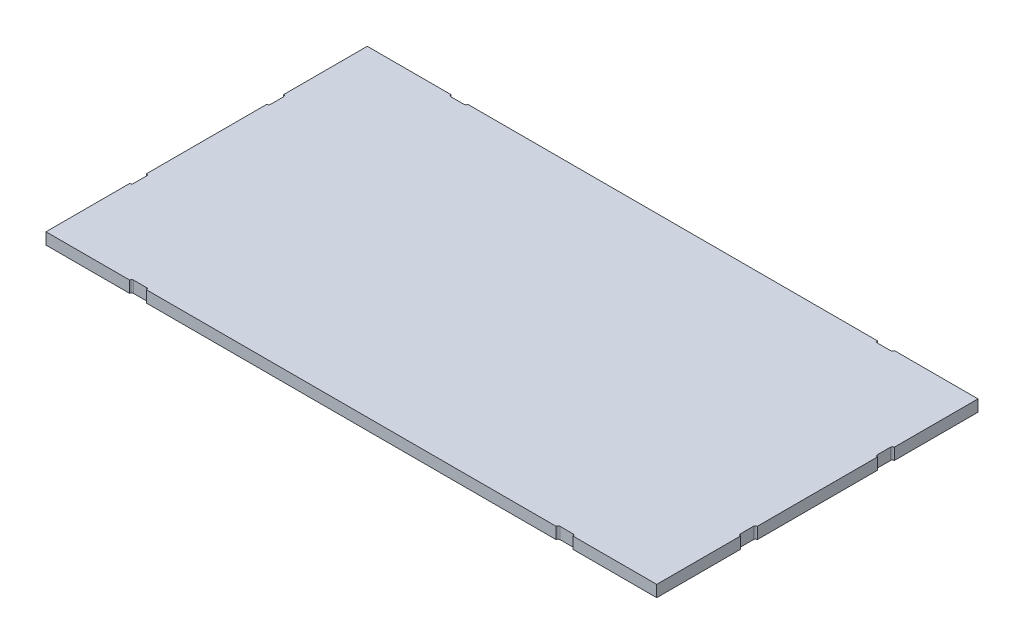
ISO-10303-21;
HEADER;
FILE_DESCRIPTION(('STEP AP214'),'2;1');
FILE_NAME('part.step','',(''),(''),'','','');
FILE_SCHEMA(('AUTOMOTIVE_DESIGN { 1 0 10303 214 1 1 1 1 }'));
ENDSEC;
DATA;
#1=APPLICATION_CONTEXT('core data for automotive mechanical design processes');
#2=APPLICATION_PROTOCOL_DEFINITION('international standard','automotive_design',2000,#1);
#3=PRODUCT_CONTEXT('',#1,'mechanical');
#4=PRODUCT('Part','Part','',(#3));
#5=PRODUCT_RELATED_PRODUCT_CATEGORY('part','',(#4));
#6=PRODUCT_DEFINITION_FORMATION('','',#4);
#7=PRODUCT_DEFINITION_CONTEXT('part definition',#1,'design');
#8=PRODUCT_DEFINITION('design','',#6,#7);
#9=PRODUCT_DEFINITION_SHAPE('','',#8);
#10=(LENGTH_UNIT() NAMED_UNIT(*) SI_UNIT(.MILLI.,.METRE.));
#11=(NAMED_UNIT(*) PLANE_ANGLE_UNIT() SI_UNIT($,.RADIAN.));
#12=(NAMED_UNIT(*) SI_UNIT($,.STERADIAN.) SOLID_ANGLE_UNIT());
#13=UNCERTAINTY_MEASURE_WITH_UNIT(LENGTH_MEASURE(1.E-05),#10,'distance_accuracy_value','');
#14=(GEOMETRIC_REPRESENTATION_CONTEXT(3) GLOBAL_UNCERTAINTY_ASSIGNED_CONTEXT((#13)) GLOBAL_UNIT_ASSIGNED_CONTEXT((#10,
#11,#12)) REPRESENTATION_CONTEXT('',''));
#15=CARTESIAN_POINT('',(0.,0.,0.));
#16=DIRECTION('',(0.,0.,1.));
#17=DIRECTION('',(1.,0.,0.));
#18=AXIS2_PLACEMENT_3D('',#15,#16,#17);
#19=CARTESIAN_POINT('',(-316.5,12.,-166.5));
#20=DIRECTION('',(0.,0.,1.));
#21=DIRECTION('',(1.,0.,0.));
#22=AXIS2_PLACEMENT_3D('',#19,#20,#21);
#23=PLANE('',#22);
#24=DIRECTION('',(-1.,0.,0.));
#25=VECTOR('',#24,1.);
#26=CARTESIAN_POINT('',(-316.5,0.,-166.5));
#27=LINE('',#26,#25);
#28=CARTESIAN_POINT('',(212.25,0.,-166.5));
#29=VERTEX_POINT('',#28);
#30=CARTESIAN_POINT('',(-212.25,0.,-166.5));
#31=VERTEX_POINT('',#30);
#32=EDGE_CURVE('E289',#29,#31,#27,.T.);
#33=ORIENTED_EDGE('',*,*,#32,.T.);
#34=DIRECTION('',(0.,1.,0.));
#35=VECTOR('',#34,1.);
#36=CARTESIAN_POINT('',(-212.25,0.,-166.5));
#37=LINE('',#36,#35);
#38=CARTESIAN_POINT('',(-212.25,12.,-166.5));
#39=VERTEX_POINT('',#38);
#40=EDGE_CURVE('E875',#31,#39,#37,.T.);
#41=ORIENTED_EDGE('',*,*,#40,.T.);
#42=DIRECTION('',(-1.,0.,0.));
#43=VECTOR('',#42,1.);
#44=CARTESIAN_POINT('',(-316.5,12.,-166.5));
#45=LINE('',#44,#43);
#46=CARTESIAN_POINT('',(212.25,12.,-166.5));
#47=VERTEX_POINT('',#46);
#48=EDGE_CURVE('E343',#47,#39,#45,.T.);
#49=ORIENTED_EDGE('',*,*,#48,.F.);
#50=DIRECTION('',(0.,1.,0.));
#51=VECTOR('',#50,1.);
#52=CARTESIAN_POINT('',(212.25,0.,-166.5));
#53=LINE('',#52,#51);
#54=EDGE_CURVE('E561',#29,#47,#53,.T.);
#55=ORIENTED_EDGE('',*,*,#54,.F.);
#56=EDGE_LOOP('',(#33,#41,#49,#55));
#57=FACE_BOUND('',#56,.T.);
#58=ADVANCED_FACE('F32',(#57),#23,.F.);
#59=CARTESIAN_POINT('',(316.5,0.,-166.5));
#60=VERTEX_POINT('',#59);
#61=CARTESIAN_POINT('',(229.75,0.,-166.5));
#62=VERTEX_POINT('',#61);
#63=EDGE_CURVE('E292',#60,#62,#27,.T.);
#64=ORIENTED_EDGE('',*,*,#63,.T.);
#65=DIRECTION('',(0.,1.,0.));
#66=VECTOR('',#65,1.);
#67=CARTESIAN_POINT('',(229.75,0.,-166.5));
#68=LINE('',#67,#66);
#69=CARTESIAN_POINT('',(229.75,12.,-166.5));
#70=VERTEX_POINT('',#69);
#71=EDGE_CURVE('E544',#62,#70,#68,.T.);
#72=ORIENTED_EDGE('',*,*,#71,.T.);
#73=CARTESIAN_POINT('',(316.5,12.,-166.5));
#74=VERTEX_POINT('',#73);
#75=EDGE_CURVE('E344',#74,#70,#45,.T.);
#76=ORIENTED_EDGE('',*,*,#75,.F.);
#77=DIRECTION('',(0.,-1.,0.));
#78=VECTOR('',#77,1.);
#79=CARTESIAN_POINT('',(316.5,12.,-166.5));
#80=LINE('',#79,#78);
#81=EDGE_CURVE('E11',#74,#60,#80,.T.);
#82=ORIENTED_EDGE('',*,*,#81,.T.);
#83=EDGE_LOOP('',(#64,#72,#76,#82));
#84=FACE_BOUND('',#83,.T.);
#85=ADVANCED_FACE('F543',(#84),#23,.F.);
#86=CARTESIAN_POINT('',(-316.5,12.,-166.5));
#87=DIRECTION('',(1.,0.,0.));
#88=DIRECTION('',(0.,0.,-1.));
#89=AXIS2_PLACEMENT_3D('',#86,#87,#88);
#90=PLANE('',#89);
#91=DIRECTION('',(0.,0.,1.));
#92=VECTOR('',#91,1.);
#93=CARTESIAN_POINT('',(-316.5,0.,-166.5));
#94=LINE('',#93,#92);
#95=CARTESIAN_POINT('',(-316.5,0.,-62.2499999999997));
#96=VERTEX_POINT('',#95);
#97=CARTESIAN_POINT('',(-316.5,0.,62.2499999999997));
#98=VERTEX_POINT('',#97);
#99=EDGE_CURVE('E304',#96,#98,#94,.T.);
#100=ORIENTED_EDGE('',*,*,#99,.T.);
#101=DIRECTION('',(0.,1.,0.));
#102=VECTOR('',#101,1.);
#103=CARTESIAN_POINT('',(-316.5,0.,62.2499999999997));
#104=LINE('',#103,#102);
#105=CARTESIAN_POINT('',(-316.5,12.,62.2499999999997));
#106=VERTEX_POINT('',#105);
#107=EDGE_CURVE('E578',#98,#106,#104,.T.);
#108=ORIENTED_EDGE('',*,*,#107,.T.);
#109=DIRECTION('',(0.,0.,1.));
#110=VECTOR('',#109,1.);
#111=CARTESIAN_POINT('',(-316.5,12.,-166.5));
#112=LINE('',#111,#110);
#113=CARTESIAN_POINT('',(-316.5,12.,-62.2499999999997));
#114=VERTEX_POINT('',#113);
#115=EDGE_CURVE('E350',#114,#106,#112,.T.);
#116=ORIENTED_EDGE('',*,*,#115,.F.);
#117=DIRECTION('',(0.,1.,0.));
#118=VECTOR('',#117,1.);
#119=CARTESIAN_POINT('',(-316.5,0.,-62.2499999999997));
#120=LINE('',#119,#118);
#121=EDGE_CURVE('E389',#96,#114,#120,.T.);
#122=ORIENTED_EDGE('',*,*,#121,.F.);
#123=EDGE_LOOP('',(#100,#108,#116,#122));
#124=FACE_BOUND('',#123,.T.);
#125=ADVANCED_FACE('F607',(#124),#90,.F.);
#126=CARTESIAN_POINT('',(-316.5,0.,-166.5));
#127=VERTEX_POINT('',#126);
#128=CARTESIAN_POINT('',(-316.5,0.,-79.7499999999997));
#129=VERTEX_POINT('',#128);
#130=EDGE_CURVE('E288',#127,#129,#94,.T.);
#131=ORIENTED_EDGE('',*,*,#130,.T.);
#132=DIRECTION('',(0.,1.,0.));
#133=VECTOR('',#132,1.);
#134=CARTESIAN_POINT('',(-316.5,0.,-79.7499999999997));
#135=LINE('',#134,#133);
#136=CARTESIAN_POINT('',(-316.5,12.,-79.7499999999997));
#137=VERTEX_POINT('',#136);
#138=EDGE_CURVE('E373',#129,#137,#135,.T.);
#139=ORIENTED_EDGE('',*,*,#138,.T.);
#140=CARTESIAN_POINT('',(-316.5,12.,-166.5));
#141=VERTEX_POINT('',#140);
#142=EDGE_CURVE('E351',#141,#137,#112,.T.);
#143=ORIENTED_EDGE('',*,*,#142,.F.);
#144=DIRECTION('',(0.,-1.,0.));
#145=VECTOR('',#144,1.);
#146=CARTESIAN_POINT('',(-316.5,12.,-166.5));
#147=LINE('',#146,#145);
#148=EDGE_CURVE('E40',#141,#127,#147,.T.);
#149=ORIENTED_EDGE('',*,*,#148,.T.);
#150=EDGE_LOOP('',(#131,#139,#143,#149));
#151=FACE_BOUND('',#150,.T.);
#152=ADVANCED_FACE('F372',(#151),#90,.F.);
#153=CARTESIAN_POINT('',(316.5,12.,-166.5));
#154=DIRECTION('',(-1.,0.,0.));
#155=DIRECTION('',(0.,0.,1.));
#156=AXIS2_PLACEMENT_3D('',#153,#154,#155);
#157=PLANE('',#156);
#158=DIRECTION('',(0.,0.,-1.));
#159=VECTOR('',#158,1.);
#160=CARTESIAN_POINT('',(316.5,0.,-166.5));
#161=LINE('',#160,#159);
#162=CARTESIAN_POINT('',(316.5,0.,62.2499999999997));
#163=VERTEX_POINT('',#162);
#164=CARTESIAN_POINT('',(316.5,0.,-62.2499999999997));
#165=VERTEX_POINT('',#164);
#166=EDGE_CURVE('E295',#163,#165,#161,.T.);
#167=ORIENTED_EDGE('',*,*,#166,.T.);
#168=DIRECTION('',(0.,1.,0.));
#169=VECTOR('',#168,1.);
#170=CARTESIAN_POINT('',(316.5,0.,-62.2499999999997));
#171=LINE('',#170,#169);
#172=CARTESIAN_POINT('',(316.5,12.,-62.2499999999997));
#173=VERTEX_POINT('',#172);
#174=EDGE_CURVE('E406',#165,#173,#171,.T.);
#175=ORIENTED_EDGE('',*,*,#174,.T.);
#176=DIRECTION('',(0.,0.,-1.));
#177=VECTOR('',#176,1.);
#178=CARTESIAN_POINT('',(316.5,12.,-166.5));
#179=LINE('',#178,#177);
#180=CARTESIAN_POINT('',(316.5,12.,62.2499999999997));
#181=VERTEX_POINT('',#180);
#182=EDGE_CURVE('E329',#181,#173,#179,.T.);
#183=ORIENTED_EDGE('',*,*,#182,.F.);
#184=DIRECTION('',(0.,1.,0.));
#185=VECTOR('',#184,1.);
#186=CARTESIAN_POINT('',(316.5,0.,62.2499999999997));
#187=LINE('',#186,#185);
#188=EDGE_CURVE('E451',#163,#181,#187,.T.);
#189=ORIENTED_EDGE('',*,*,#188,.F.);
#190=EDGE_LOOP('',(#167,#175,#183,#189));
#191=FACE_BOUND('',#190,.T.);
#192=ADVANCED_FACE('F529',(#191),#157,.F.);
#193=CARTESIAN_POINT('',(-316.5,12.,166.5));
#194=DIRECTION('',(0.,0.,-1.));
#195=DIRECTION('',(-1.,0.,0.));
#196=AXIS2_PLACEMENT_3D('',#193,#194,#195);
#197=PLANE('',#196);
#198=DIRECTION('',(1.,0.,0.));
#199=VECTOR('',#198,1.);
#200=CARTESIAN_POINT('',(-316.5,0.,166.5));
#201=LINE('',#200,#199);
#202=CARTESIAN_POINT('',(-212.25,0.,166.5));
#203=VERTEX_POINT('',#202);
#204=CARTESIAN_POINT('',(212.25,0.,166.5));
#205=VERTEX_POINT('',#204);
#206=EDGE_CURVE('E315',#203,#205,#201,.T.);
#207=ORIENTED_EDGE('',*,*,#206,.T.);
#208=DIRECTION('',(0.,1.,0.));
#209=VECTOR('',#208,1.);
#210=CARTESIAN_POINT('',(212.25,0.,166.5));
#211=LINE('',#210,#209);
#212=CARTESIAN_POINT('',(212.25,12.,166.5));
#213=VERTEX_POINT('',#212);
#214=EDGE_CURVE('E432',#205,#213,#211,.T.);
#215=ORIENTED_EDGE('',*,*,#214,.T.);
#216=DIRECTION('',(1.,0.,0.));
#217=VECTOR('',#216,1.);
#218=CARTESIAN_POINT('',(-316.5,12.,166.5));
#219=LINE('',#218,#217);
#220=CARTESIAN_POINT('',(-212.25,12.,166.5));
#221=VERTEX_POINT('',#220);
#222=EDGE_CURVE('E360',#221,#213,#219,.T.);
#223=ORIENTED_EDGE('',*,*,#222,.F.);
#224=DIRECTION('',(0.,1.,0.));
#225=VECTOR('',#224,1.);
#226=CARTESIAN_POINT('',(-212.25,0.,166.5));
#227=LINE('',#226,#225);
#228=EDGE_CURVE('E477',#203,#221,#227,.T.);
#229=ORIENTED_EDGE('',*,*,#228,.F.);
#230=EDGE_LOOP('',(#207,#215,#223,#229));
#231=FACE_BOUND('',#230,.T.);
#232=ADVANCED_FACE('F501',(#231),#197,.F.);
#233=CARTESIAN_POINT('',(316.5,0.,166.5));
#234=VERTEX_POINT('',#233);
#235=CARTESIAN_POINT('',(316.5,0.,79.7499999999997));
#236=VERTEX_POINT('',#235);
#237=EDGE_CURVE('E290',#234,#236,#161,.T.);
#238=ORIENTED_EDGE('',*,*,#237,.T.);
#239=DIRECTION('',(0.,1.,0.));
#240=VECTOR('',#239,1.);
#241=CARTESIAN_POINT('',(316.5,0.,79.7499999999997));
#242=LINE('',#241,#240);
#243=CARTESIAN_POINT('',(316.5,12.,79.7499999999997));
#244=VERTEX_POINT('',#243);
#245=EDGE_CURVE('E458',#236,#244,#242,.T.);
#246=ORIENTED_EDGE('',*,*,#245,.T.);
#247=CARTESIAN_POINT('',(316.5,12.,166.5));
#248=VERTEX_POINT('',#247);
#249=EDGE_CURVE('E331',#248,#244,#179,.T.);
#250=ORIENTED_EDGE('',*,*,#249,.F.);
#251=DIRECTION('',(0.,-1.,0.));
#252=VECTOR('',#251,1.);
#253=CARTESIAN_POINT('',(316.5,12.,166.5));
#254=LINE('',#253,#252);
#255=EDGE_CURVE('E365',#248,#234,#254,.T.);
#256=ORIENTED_EDGE('',*,*,#255,.T.);
#257=EDGE_LOOP('',(#238,#246,#250,#256));
#258=FACE_BOUND('',#257,.T.);
#259=ADVANCED_FACE('F512',(#258),#157,.F.);
#260=CARTESIAN_POINT('',(-316.5,0.,166.5));
#261=VERTEX_POINT('',#260);
#262=CARTESIAN_POINT('',(-229.75,0.,166.5));
#263=VERTEX_POINT('',#262);
#264=EDGE_CURVE('E316',#261,#263,#201,.T.);
#265=ORIENTED_EDGE('',*,*,#264,.T.);
#266=DIRECTION('',(0.,1.,0.));
#267=VECTOR('',#266,1.);
#268=CARTESIAN_POINT('',(-229.75,0.,166.5));
#269=LINE('',#268,#267);
#270=CARTESIAN_POINT('',(-229.75,12.,166.5));
#271=VERTEX_POINT('',#270);
#272=EDGE_CURVE('E484',#263,#271,#269,.T.);
#273=ORIENTED_EDGE('',*,*,#272,.T.);
#274=CARTESIAN_POINT('',(-316.5,12.,166.5));
#275=VERTEX_POINT('',#274);
#276=EDGE_CURVE('E361',#275,#271,#219,.T.);
#277=ORIENTED_EDGE('',*,*,#276,.F.);
#278=DIRECTION('',(0.,-1.,0.));
#279=VECTOR('',#278,1.);
#280=CARTESIAN_POINT('',(-316.5,12.,166.5));
#281=LINE('',#280,#279);
#282=EDGE_CURVE('E368',#275,#261,#281,.T.);
#283=ORIENTED_EDGE('',*,*,#282,.T.);
#284=EDGE_LOOP('',(#265,#273,#277,#283));
#285=FACE_BOUND('',#284,.T.);
#286=ADVANCED_FACE('F619',(#285),#197,.F.);
#287=CARTESIAN_POINT('',(316.5,12.,-79.7499999999997));
#288=VERTEX_POINT('',#287);
#289=EDGE_CURVE('E325',#288,#74,#179,.T.);
#290=ORIENTED_EDGE('',*,*,#289,.F.);
#291=DIRECTION('',(0.,1.,0.));
#292=VECTOR('',#291,1.);
#293=CARTESIAN_POINT('',(316.5,0.,-79.7499999999997));
#294=LINE('',#293,#292);
#295=CARTESIAN_POINT('',(316.5,0.,-79.7499999999997));
#296=VERTEX_POINT('',#295);
#297=EDGE_CURVE('E401',#296,#288,#294,.T.);
#298=ORIENTED_EDGE('',*,*,#297,.F.);
#299=EDGE_CURVE('E297',#296,#60,#161,.T.);
#300=ORIENTED_EDGE('',*,*,#299,.T.);
#301=ORIENTED_EDGE('',*,*,#81,.F.);
#302=EDGE_LOOP('',(#290,#298,#300,#301));
#303=FACE_BOUND('',#302,.T.);
#304=ADVANCED_FACE('F34',(#303),#157,.F.);
#305=CARTESIAN_POINT('',(-229.75,12.,-166.5));
#306=VERTEX_POINT('',#305);
#307=EDGE_CURVE('E281',#306,#141,#45,.T.);
#308=ORIENTED_EDGE('',*,*,#307,.F.);
#309=DIRECTION('',(0.,1.,0.));
#310=VECTOR('',#309,1.);
#311=CARTESIAN_POINT('',(-229.75,0.,-166.5));
#312=LINE('',#311,#310);
#313=CARTESIAN_POINT('',(-229.75,0.,-166.5));
#314=VERTEX_POINT('',#313);
#315=EDGE_CURVE('E268',#314,#306,#312,.T.);
#316=ORIENTED_EDGE('',*,*,#315,.F.);
#317=EDGE_CURVE('E279',#314,#127,#27,.T.);
#318=ORIENTED_EDGE('',*,*,#317,.T.);
#319=ORIENTED_EDGE('',*,*,#148,.F.);
#320=EDGE_LOOP('',(#308,#316,#318,#319));
#321=FACE_BOUND('',#320,.T.);
#322=ADVANCED_FACE('F277',(#321),#23,.F.);
#323=CARTESIAN_POINT('',(-316.5,12.,79.7499999999997));
#324=VERTEX_POINT('',#323);
#325=EDGE_CURVE('E348',#324,#275,#112,.T.);
#326=ORIENTED_EDGE('',*,*,#325,.F.);
#327=DIRECTION('',(0.,1.,0.));
#328=VECTOR('',#327,1.);
#329=CARTESIAN_POINT('',(-316.5,0.,79.7499999999997));
#330=LINE('',#329,#328);
#331=CARTESIAN_POINT('',(-316.5,0.,79.7499999999997));
#332=VERTEX_POINT('',#331);
#333=EDGE_CURVE('E573',#332,#324,#330,.T.);
#334=ORIENTED_EDGE('',*,*,#333,.F.);
#335=EDGE_CURVE('E300',#332,#261,#94,.T.);
#336=ORIENTED_EDGE('',*,*,#335,.T.);
#337=ORIENTED_EDGE('',*,*,#282,.F.);
#338=EDGE_LOOP('',(#326,#334,#336,#337));
#339=FACE_BOUND('',#338,.T.);
#340=ADVANCED_FACE('F618',(#339),#90,.F.);
#341=CARTESIAN_POINT('',(229.75,12.,166.5));
#342=VERTEX_POINT('',#341);
#343=EDGE_CURVE('E357',#342,#248,#219,.T.);
#344=ORIENTED_EDGE('',*,*,#343,.F.);
#345=DIRECTION('',(0.,1.,0.));
#346=VECTOR('',#345,1.);
#347=CARTESIAN_POINT('',(229.75,0.,166.5));
#348=LINE('',#347,#346);
#349=CARTESIAN_POINT('',(229.75,0.,166.5));
#350=VERTEX_POINT('',#349);
#351=EDGE_CURVE('E425',#350,#342,#348,.T.);
#352=ORIENTED_EDGE('',*,*,#351,.F.);
#353=EDGE_CURVE('E312',#350,#234,#201,.T.);
#354=ORIENTED_EDGE('',*,*,#353,.T.);
#355=ORIENTED_EDGE('',*,*,#255,.F.);
#356=EDGE_LOOP('',(#344,#352,#354,#355));
#357=FACE_BOUND('',#356,.T.);
#358=ADVANCED_FACE('F511',(#357),#197,.F.);
#359=CARTESIAN_POINT('',(0.,12.,0.));
#360=DIRECTION('',(0.,1.,0.));
#361=DIRECTION('',(0.,0.,1.));
#362=AXIS2_PLACEMENT_3D('',#359,#360,#361);
#363=PLANE('',#362);
#364=CARTESIAN_POINT('',(-214.25,12.,-166.5));
#365=DIRECTION('',(0.,1.,0.));
#366=DIRECTION('',(0.,0.,-1.));
#367=AXIS2_PLACEMENT_3D('',#364,#365,#366);
#368=CIRCLE('',#367,2.);
#369=CARTESIAN_POINT('',(-214.25,12.,-164.5));
#370=VERTEX_POINT('',#369);
#371=EDGE_CURVE('E273',#370,#39,#368,.T.);
#372=ORIENTED_EDGE('',*,*,#371,.F.);
#373=DIRECTION('',(1.,0.,0.));
#374=VECTOR('',#373,1.);
#375=CARTESIAN_POINT('',(-227.75,12.,-164.5));
#376=LINE('',#375,#374);
#377=CARTESIAN_POINT('',(-227.75,12.,-164.5));
#378=VERTEX_POINT('',#377);
#379=EDGE_CURVE('E864',#378,#370,#376,.T.);
#380=ORIENTED_EDGE('',*,*,#379,.F.);
#381=CARTESIAN_POINT('',(-227.75,12.,-166.5));
#382=DIRECTION('',(0.,1.,0.));
#383=DIRECTION('',(0.,0.,-1.));
#384=AXIS2_PLACEMENT_3D('',#381,#382,#383);
#385=CIRCLE('',#384,1.99999999999999);
#386=EDGE_CURVE('E867',#306,#378,#385,.T.);
#387=ORIENTED_EDGE('',*,*,#386,.F.);
#388=ORIENTED_EDGE('',*,*,#307,.T.);
#389=ORIENTED_EDGE('',*,*,#142,.T.);
#390=CARTESIAN_POINT('',(-316.5,12.,-77.7499999999997));
#391=DIRECTION('',(0.,1.,0.));
#392=DIRECTION('',(0.,0.,1.));
#393=AXIS2_PLACEMENT_3D('',#390,#391,#392);
#394=CIRCLE('',#393,2.);
#395=CARTESIAN_POINT('',(-314.5,12.,-77.7499999999997));
#396=VERTEX_POINT('',#395);
#397=EDGE_CURVE('E385',#396,#137,#394,.T.);
#398=ORIENTED_EDGE('',*,*,#397,.F.);
#399=DIRECTION('',(0.,0.,-1.));
#400=VECTOR('',#399,1.);
#401=CARTESIAN_POINT('',(-314.5,12.,-64.2499999999997));
#402=LINE('',#401,#400);
#403=CARTESIAN_POINT('',(-314.5,12.,-64.2499999999997));
#404=VERTEX_POINT('',#403);
#405=EDGE_CURVE('E595',#404,#396,#402,.T.);
#406=ORIENTED_EDGE('',*,*,#405,.F.);
#407=CARTESIAN_POINT('',(-316.5,12.,-64.2499999999997));
#408=DIRECTION('',(0.,1.,0.));
#409=DIRECTION('',(0.,0.,-1.));
#410=AXIS2_PLACEMENT_3D('',#407,#408,#409);
#411=CIRCLE('',#410,2.);
#412=EDGE_CURVE('E581',#114,#404,#411,.T.);
#413=ORIENTED_EDGE('',*,*,#412,.F.);
#414=ORIENTED_EDGE('',*,*,#115,.T.);
#415=CARTESIAN_POINT('',(-316.5,12.,64.2499999999997));
#416=DIRECTION('',(0.,1.,0.));
#417=DIRECTION('',(0.,0.,1.));
#418=AXIS2_PLACEMENT_3D('',#415,#416,#417);
#419=CIRCLE('',#418,2.);
#420=CARTESIAN_POINT('',(-314.5,12.,64.2499999999997));
#421=VERTEX_POINT('',#420);
#422=EDGE_CURVE('E568',#421,#106,#419,.T.);
#423=ORIENTED_EDGE('',*,*,#422,.F.);
#424=DIRECTION('',(0.,0.,-1.));
#425=VECTOR('',#424,1.);
#426=CARTESIAN_POINT('',(-314.5,12.,64.2499999999997));
#427=LINE('',#426,#425);
#428=CARTESIAN_POINT('',(-314.5,12.,77.7499999999997));
#429=VERTEX_POINT('',#428);
#430=EDGE_CURVE('E552',#429,#421,#427,.T.);
#431=ORIENTED_EDGE('',*,*,#430,.F.);
#432=CARTESIAN_POINT('',(-316.5,12.,77.7499999999997));
#433=DIRECTION('',(0.,1.,0.));
#434=DIRECTION('',(0.,0.,-1.));
#435=AXIS2_PLACEMENT_3D('',#432,#433,#434);
#436=CIRCLE('',#435,2.);
#437=EDGE_CURVE('E548',#324,#429,#436,.T.);
#438=ORIENTED_EDGE('',*,*,#437,.F.);
#439=ORIENTED_EDGE('',*,*,#325,.T.);
#440=ORIENTED_EDGE('',*,*,#276,.T.);
#441=CARTESIAN_POINT('',(-227.75,12.,166.5));
#442=DIRECTION('',(0.,1.,0.));
#443=DIRECTION('',(0.,0.,1.));
#444=AXIS2_PLACEMENT_3D('',#441,#442,#443);
#445=CIRCLE('',#444,1.99999999999999);
#446=CARTESIAN_POINT('',(-227.75,12.,164.5));
#447=VERTEX_POINT('',#446);
#448=EDGE_CURVE('E471',#447,#271,#445,.T.);
#449=ORIENTED_EDGE('',*,*,#448,.F.);
#450=DIRECTION('',(-1.,0.,0.));
#451=VECTOR('',#450,1.);
#452=CARTESIAN_POINT('',(-227.75,12.,164.5));
#453=LINE('',#452,#451);
#454=CARTESIAN_POINT('',(-214.25,12.,164.5));
#455=VERTEX_POINT('',#454);
#456=EDGE_CURVE('E480',#455,#447,#453,.T.);
#457=ORIENTED_EDGE('',*,*,#456,.F.);
#458=CARTESIAN_POINT('',(-214.25,12.,166.5));
#459=DIRECTION('',(0.,1.,0.));
#460=DIRECTION('',(0.,0.,1.));
#461=AXIS2_PLACEMENT_3D('',#458,#459,#460);
#462=CIRCLE('',#461,2.);
#463=EDGE_CURVE('E461',#221,#455,#462,.T.);
#464=ORIENTED_EDGE('',*,*,#463,.F.);
#465=ORIENTED_EDGE('',*,*,#222,.T.);
#466=CARTESIAN_POINT('',(214.25,12.,166.5));
#467=DIRECTION('',(0.,1.,0.));
#468=DIRECTION('',(0.,0.,-1.));
#469=AXIS2_PLACEMENT_3D('',#466,#467,#468);
#470=CIRCLE('',#469,2.);
#471=CARTESIAN_POINT('',(214.25,12.,164.5));
#472=VERTEX_POINT('',#471);
#473=EDGE_CURVE('E419',#472,#213,#470,.T.);
#474=ORIENTED_EDGE('',*,*,#473,.F.);
#475=DIRECTION('',(-1.,0.,0.));
#476=VECTOR('',#475,1.);
#477=CARTESIAN_POINT('',(227.75,12.,164.5));
#478=LINE('',#477,#476);
#479=CARTESIAN_POINT('',(227.75,12.,164.5));
#480=VERTEX_POINT('',#479);
#481=EDGE_CURVE('E428',#480,#472,#478,.T.);
#482=ORIENTED_EDGE('',*,*,#481,.F.);
#483=CARTESIAN_POINT('',(227.75,12.,166.5));
#484=DIRECTION('',(0.,1.,0.));
#485=DIRECTION('',(0.,0.,-1.));
#486=AXIS2_PLACEMENT_3D('',#483,#484,#485);
#487=CIRCLE('',#486,1.99999999999999);
#488=EDGE_CURVE('E409',#342,#480,#487,.T.);
#489=ORIENTED_EDGE('',*,*,#488,.F.);
#490=ORIENTED_EDGE('',*,*,#343,.T.);
#491=ORIENTED_EDGE('',*,*,#249,.T.);
#492=CARTESIAN_POINT('',(316.5,12.,77.7499999999997));
#493=DIRECTION('',(0.,1.,0.));
#494=DIRECTION('',(0.,0.,1.));
#495=AXIS2_PLACEMENT_3D('',#492,#493,#494);
#496=CIRCLE('',#495,2.);
#497=CARTESIAN_POINT('',(314.5,12.,77.7499999999997));
#498=VERTEX_POINT('',#497);
#499=EDGE_CURVE('E445',#498,#244,#496,.T.);
#500=ORIENTED_EDGE('',*,*,#499,.F.);
#501=DIRECTION('',(0.,0.,1.));
#502=VECTOR('',#501,1.);
#503=CARTESIAN_POINT('',(314.5,12.,64.2499999999997));
#504=LINE('',#503,#502);
#505=CARTESIAN_POINT('',(314.5,12.,64.2499999999997));
#506=VERTEX_POINT('',#505);
#507=EDGE_CURVE('E454',#506,#498,#504,.T.);
#508=ORIENTED_EDGE('',*,*,#507,.F.);
#509=CARTESIAN_POINT('',(316.5,12.,64.2499999999997));
#510=DIRECTION('',(0.,1.,0.));
#511=DIRECTION('',(0.,0.,-1.));
#512=AXIS2_PLACEMENT_3D('',#509,#510,#511);
#513=CIRCLE('',#512,2.);
#514=EDGE_CURVE('E435',#181,#506,#513,.T.);
#515=ORIENTED_EDGE('',*,*,#514,.F.);
#516=ORIENTED_EDGE('',*,*,#182,.T.);
#517=CARTESIAN_POINT('',(316.5,12.,-64.2499999999997));
#518=DIRECTION('',(0.,1.,0.));
#519=DIRECTION('',(0.,0.,1.));
#520=AXIS2_PLACEMENT_3D('',#517,#518,#519);
#521=CIRCLE('',#520,2.);
#522=CARTESIAN_POINT('',(314.5,12.,-64.2499999999997));
#523=VERTEX_POINT('',#522);
#524=EDGE_CURVE('E396',#523,#173,#521,.T.);
#525=ORIENTED_EDGE('',*,*,#524,.F.);
#526=DIRECTION('',(0.,0.,1.));
#527=VECTOR('',#526,1.);
#528=CARTESIAN_POINT('',(314.5,12.,-64.2499999999997));
#529=LINE('',#528,#527);
#530=CARTESIAN_POINT('',(314.5,12.,-77.7499999999997));
#531=VERTEX_POINT('',#530);
#532=EDGE_CURVE('E380',#531,#523,#529,.T.);
#533=ORIENTED_EDGE('',*,*,#532,.F.);
#534=CARTESIAN_POINT('',(316.5,12.,-77.7499999999997));
#535=DIRECTION('',(0.,1.,0.));
#536=DIRECTION('',(0.,0.,-1.));
#537=AXIS2_PLACEMENT_3D('',#534,#535,#536);
#538=CIRCLE('',#537,2.);
#539=EDGE_CURVE('E376',#288,#531,#538,.T.);
#540=ORIENTED_EDGE('',*,*,#539,.F.);
#541=ORIENTED_EDGE('',*,*,#289,.T.);
#542=ORIENTED_EDGE('',*,*,#75,.T.);
#543=CARTESIAN_POINT('',(227.75,12.,-166.5));
#544=DIRECTION('',(0.,1.,0.));
#545=DIRECTION('',(0.,0.,1.));
#546=AXIS2_PLACEMENT_3D('',#543,#544,#545);
#547=CIRCLE('',#546,1.99999999999999);
#548=CARTESIAN_POINT('',(227.75,12.,-164.5));
#549=VERTEX_POINT('',#548);
#550=EDGE_CURVE('E557',#549,#70,#547,.T.);
#551=ORIENTED_EDGE('',*,*,#550,.F.);
#552=DIRECTION('',(1.,0.,0.));
#553=VECTOR('',#552,1.);
#554=CARTESIAN_POINT('',(227.75,12.,-164.5));
#555=LINE('',#554,#553);
#556=CARTESIAN_POINT('',(214.25,12.,-164.5));
#557=VERTEX_POINT('',#556);
#558=EDGE_CURVE('E886',#557,#549,#555,.T.);
#559=ORIENTED_EDGE('',*,*,#558,.F.);
#560=CARTESIAN_POINT('',(214.25,12.,-166.5));
#561=DIRECTION('',(0.,1.,0.));
#562=DIRECTION('',(0.,0.,1.));
#563=AXIS2_PLACEMENT_3D('',#560,#561,#562);
#564=CIRCLE('',#563,2.);
#565=EDGE_CURVE('E877',#47,#557,#564,.T.);
#566=ORIENTED_EDGE('',*,*,#565,.F.);
#567=ORIENTED_EDGE('',*,*,#48,.T.);
#568=EDGE_LOOP('',(#372,#380,#387,#388,#389,#398,#406,#413,#414,#423,#431,#438,#439,#440,#449,
#457,#464,#465,#474,#482,#489,#490,#491,#500,#508,#515,#516,#525,#533,#540,#541,#542,#551,#559,
#566,#567));
#569=FACE_BOUND('',#568,.T.);
#570=ADVANCED_FACE('F499',(#569),#363,.T.);
#571=CARTESIAN_POINT('',(0.,0.,0.));
#572=DIRECTION('',(0.,1.,0.));
#573=DIRECTION('',(0.,0.,1.));
#574=AXIS2_PLACEMENT_3D('',#571,#572,#573);
#575=PLANE('',#574);
#576=DIRECTION('',(1.,0.,0.));
#577=VECTOR('',#576,1.);
#578=CARTESIAN_POINT('',(-227.75,0.,-164.5));
#579=LINE('',#578,#577);
#580=CARTESIAN_POINT('',(-227.75,0.,-164.5));
#581=VERTEX_POINT('',#580);
#582=CARTESIAN_POINT('',(-214.25,0.,-164.5));
#583=VERTEX_POINT('',#582);
#584=EDGE_CURVE('E47',#581,#583,#579,.T.);
#585=ORIENTED_EDGE('',*,*,#584,.T.);
#586=CARTESIAN_POINT('',(-214.25,0.,-166.5));
#587=DIRECTION('',(0.,1.,0.));
#588=DIRECTION('',(0.,0.,-1.));
#589=AXIS2_PLACEMENT_3D('',#586,#587,#588);
#590=CIRCLE('',#589,2.);
#591=EDGE_CURVE('E282',#583,#31,#590,.T.);
#592=ORIENTED_EDGE('',*,*,#591,.T.);
#593=ORIENTED_EDGE('',*,*,#32,.F.);
#594=CARTESIAN_POINT('',(214.25,0.,-166.5));
#595=DIRECTION('',(0.,1.,0.));
#596=DIRECTION('',(0.,0.,1.));
#597=AXIS2_PLACEMENT_3D('',#594,#595,#596);
#598=CIRCLE('',#597,2.);
#599=CARTESIAN_POINT('',(214.25,0.,-164.5));
#600=VERTEX_POINT('',#599);
#601=EDGE_CURVE('E880',#29,#600,#598,.T.);
#602=ORIENTED_EDGE('',*,*,#601,.T.);
#603=DIRECTION('',(1.,0.,0.));
#604=VECTOR('',#603,1.);
#605=CARTESIAN_POINT('',(227.75,0.,-164.5));
#606=LINE('',#605,#604);
#607=CARTESIAN_POINT('',(227.75,0.,-164.5));
#608=VERTEX_POINT('',#607);
#609=EDGE_CURVE('E55',#600,#608,#606,.T.);
#610=ORIENTED_EDGE('',*,*,#609,.T.);
#611=CARTESIAN_POINT('',(227.75,0.,-166.5));
#612=DIRECTION('',(0.,1.,0.));
#613=DIRECTION('',(0.,0.,1.));
#614=AXIS2_PLACEMENT_3D('',#611,#612,#613);
#615=CIRCLE('',#614,1.99999999999999);
#616=EDGE_CURVE('E563',#608,#62,#615,.T.);
#617=ORIENTED_EDGE('',*,*,#616,.T.);
#618=ORIENTED_EDGE('',*,*,#63,.F.);
#619=ORIENTED_EDGE('',*,*,#299,.F.);
#620=CARTESIAN_POINT('',(316.5,0.,-77.7499999999997));
#621=DIRECTION('',(0.,1.,0.));
#622=DIRECTION('',(0.,0.,-1.));
#623=AXIS2_PLACEMENT_3D('',#620,#621,#622);
#624=CIRCLE('',#623,2.);
#625=CARTESIAN_POINT('',(314.5,0.,-77.7499999999997));
#626=VERTEX_POINT('',#625);
#627=EDGE_CURVE('E392',#296,#626,#624,.T.);
#628=ORIENTED_EDGE('',*,*,#627,.T.);
#629=DIRECTION('',(0.,0.,1.));
#630=VECTOR('',#629,1.);
#631=CARTESIAN_POINT('',(314.5,0.,-64.2499999999997));
#632=LINE('',#631,#630);
#633=CARTESIAN_POINT('',(314.5,0.,-64.2499999999997));
#634=VERTEX_POINT('',#633);
#635=EDGE_CURVE('E395',#626,#634,#632,.T.);
#636=ORIENTED_EDGE('',*,*,#635,.T.);
#637=CARTESIAN_POINT('',(316.5,0.,-64.2499999999997));
#638=DIRECTION('',(0.,1.,0.));
#639=DIRECTION('',(0.,0.,1.));
#640=AXIS2_PLACEMENT_3D('',#637,#638,#639);
#641=CIRCLE('',#640,2.);
#642=EDGE_CURVE('E399',#634,#165,#641,.T.);
#643=ORIENTED_EDGE('',*,*,#642,.T.);
#644=ORIENTED_EDGE('',*,*,#166,.F.);
#645=CARTESIAN_POINT('',(316.5,0.,64.2499999999997));
#646=DIRECTION('',(0.,1.,0.));
#647=DIRECTION('',(0.,0.,-1.));
#648=AXIS2_PLACEMENT_3D('',#645,#646,#647);
#649=CIRCLE('',#648,2.);
#650=CARTESIAN_POINT('',(314.5,0.,64.2499999999997));
#651=VERTEX_POINT('',#650);
#652=EDGE_CURVE('E441',#163,#651,#649,.T.);
#653=ORIENTED_EDGE('',*,*,#652,.T.);
#654=DIRECTION('',(0.,0.,1.));
#655=VECTOR('',#654,1.);
#656=CARTESIAN_POINT('',(314.5,0.,64.2499999999997));
#657=LINE('',#656,#655);
#658=CARTESIAN_POINT('',(314.5,0.,77.7499999999997));
#659=VERTEX_POINT('',#658);
#660=EDGE_CURVE('E444',#651,#659,#657,.T.);
#661=ORIENTED_EDGE('',*,*,#660,.T.);
#662=CARTESIAN_POINT('',(316.5,0.,77.7499999999997));
#663=DIRECTION('',(0.,1.,0.));
#664=DIRECTION('',(0.,0.,1.));
#665=AXIS2_PLACEMENT_3D('',#662,#663,#664);
#666=CIRCLE('',#665,2.);
#667=EDGE_CURVE('E448',#659,#236,#666,.T.);
#668=ORIENTED_EDGE('',*,*,#667,.T.);
#669=ORIENTED_EDGE('',*,*,#237,.F.);
#670=ORIENTED_EDGE('',*,*,#353,.F.);
#671=CARTESIAN_POINT('',(227.75,0.,166.5));
#672=DIRECTION('',(0.,1.,0.));
#673=DIRECTION('',(0.,0.,-1.));
#674=AXIS2_PLACEMENT_3D('',#671,#672,#673);
#675=CIRCLE('',#674,1.99999999999999);
#676=CARTESIAN_POINT('',(227.75,0.,164.5));
#677=VERTEX_POINT('',#676);
#678=EDGE_CURVE('E415',#350,#677,#675,.T.);
#679=ORIENTED_EDGE('',*,*,#678,.T.);
#680=DIRECTION('',(-1.,0.,0.));
#681=VECTOR('',#680,1.);
#682=CARTESIAN_POINT('',(227.75,0.,164.5));
#683=LINE('',#682,#681);
#684=CARTESIAN_POINT('',(214.25,0.,164.5));
#685=VERTEX_POINT('',#684);
#686=EDGE_CURVE('E418',#677,#685,#683,.T.);
#687=ORIENTED_EDGE('',*,*,#686,.T.);
#688=CARTESIAN_POINT('',(214.25,0.,166.5));
#689=DIRECTION('',(0.,1.,0.));
#690=DIRECTION('',(0.,0.,-1.));
#691=AXIS2_PLACEMENT_3D('',#688,#689,#690);
#692=CIRCLE('',#691,2.);
#693=EDGE_CURVE('E422',#685,#205,#692,.T.);
#694=ORIENTED_EDGE('',*,*,#693,.T.);
#695=ORIENTED_EDGE('',*,*,#206,.F.);
#696=CARTESIAN_POINT('',(-214.25,0.,166.5));
#697=DIRECTION('',(0.,1.,0.));
#698=DIRECTION('',(0.,0.,1.));
#699=AXIS2_PLACEMENT_3D('',#696,#697,#698);
#700=CIRCLE('',#699,2.);
#701=CARTESIAN_POINT('',(-214.25,0.,164.5));
#702=VERTEX_POINT('',#701);
#703=EDGE_CURVE('E467',#203,#702,#700,.T.);
#704=ORIENTED_EDGE('',*,*,#703,.T.);
#705=DIRECTION('',(-1.,0.,0.));
#706=VECTOR('',#705,1.);
#707=CARTESIAN_POINT('',(-227.75,0.,164.5));
#708=LINE('',#707,#706);
#709=CARTESIAN_POINT('',(-227.75,0.,164.5));
#710=VERTEX_POINT('',#709);
#711=EDGE_CURVE('E470',#702,#710,#708,.T.);
#712=ORIENTED_EDGE('',*,*,#711,.T.);
#713=CARTESIAN_POINT('',(-227.75,0.,166.5));
#714=DIRECTION('',(0.,1.,0.));
#715=DIRECTION('',(0.,0.,1.));
#716=AXIS2_PLACEMENT_3D('',#713,#714,#715);
#717=CIRCLE('',#716,1.99999999999999);
#718=EDGE_CURVE('E474',#710,#263,#717,.T.);
#719=ORIENTED_EDGE('',*,*,#718,.T.);
#720=ORIENTED_EDGE('',*,*,#264,.F.);
#721=ORIENTED_EDGE('',*,*,#335,.F.);
#722=CARTESIAN_POINT('',(-316.5,0.,77.7499999999997));
#723=DIRECTION('',(0.,1.,0.));
#724=DIRECTION('',(0.,0.,-1.));
#725=AXIS2_PLACEMENT_3D('',#722,#723,#724);
#726=CIRCLE('',#725,2.);
#727=CARTESIAN_POINT('',(-314.5,0.,77.7499999999997));
#728=VERTEX_POINT('',#727);
#729=EDGE_CURVE('E564',#332,#728,#726,.T.);
#730=ORIENTED_EDGE('',*,*,#729,.T.);
#731=DIRECTION('',(0.,0.,-1.));
#732=VECTOR('',#731,1.);
#733=CARTESIAN_POINT('',(-314.5,0.,64.2499999999997));
#734=LINE('',#733,#732);
#735=CARTESIAN_POINT('',(-314.5,0.,64.2499999999997));
#736=VERTEX_POINT('',#735);
#737=EDGE_CURVE('E567',#728,#736,#734,.T.);
#738=ORIENTED_EDGE('',*,*,#737,.T.);
#739=CARTESIAN_POINT('',(-316.5,0.,64.2499999999997));
#740=DIRECTION('',(0.,1.,0.));
#741=DIRECTION('',(0.,0.,1.));
#742=AXIS2_PLACEMENT_3D('',#739,#740,#741);
#743=CIRCLE('',#742,2.);
#744=EDGE_CURVE('E571',#736,#98,#743,.T.);
#745=ORIENTED_EDGE('',*,*,#744,.T.);
#746=ORIENTED_EDGE('',*,*,#99,.F.);
#747=CARTESIAN_POINT('',(-316.5,0.,-64.2499999999997));
#748=DIRECTION('',(0.,1.,0.));
#749=DIRECTION('',(0.,0.,-1.));
#750=AXIS2_PLACEMENT_3D('',#747,#748,#749);
#751=CIRCLE('',#750,2.);
#752=CARTESIAN_POINT('',(-314.5,0.,-64.2499999999997));
#753=VERTEX_POINT('',#752);
#754=EDGE_CURVE('E587',#96,#753,#751,.T.);
#755=ORIENTED_EDGE('',*,*,#754,.T.);
#756=DIRECTION('',(0.,0.,-1.));
#757=VECTOR('',#756,1.);
#758=CARTESIAN_POINT('',(-314.5,0.,-64.2499999999997));
#759=LINE('',#758,#757);
#760=CARTESIAN_POINT('',(-314.5,0.,-77.7499999999997));
#761=VERTEX_POINT('',#760);
#762=EDGE_CURVE('E590',#753,#761,#759,.T.);
#763=ORIENTED_EDGE('',*,*,#762,.T.);
#764=CARTESIAN_POINT('',(-316.5,0.,-77.7499999999997));
#765=DIRECTION('',(0.,1.,0.));
#766=DIRECTION('',(0.,0.,1.));
#767=AXIS2_PLACEMENT_3D('',#764,#765,#766);
#768=CIRCLE('',#767,2.);
#769=EDGE_CURVE('E391',#761,#129,#768,.T.);
#770=ORIENTED_EDGE('',*,*,#769,.T.);
#771=ORIENTED_EDGE('',*,*,#130,.F.);
#772=ORIENTED_EDGE('',*,*,#317,.F.);
#773=CARTESIAN_POINT('',(-227.75,0.,-166.5));
#774=DIRECTION('',(0.,1.,0.));
#775=DIRECTION('',(0.,0.,-1.));
#776=AXIS2_PLACEMENT_3D('',#773,#774,#775);
#777=CIRCLE('',#776,1.99999999999999);
#778=EDGE_CURVE('E264',#314,#581,#777,.T.);
#779=ORIENTED_EDGE('',*,*,#778,.T.);
#780=EDGE_LOOP('',(#585,#592,#593,#602,#610,#617,#618,#619,#628,#636,#643,#644,#653,#661,#668,
#669,#670,#679,#687,#694,#695,#704,#712,#719,#720,#721,#730,#738,#745,#746,#755,#763,#770,#771,
#772,#779));
#781=FACE_BOUND('',#780,.T.);
#782=ADVANCED_FACE('F285',(#781),#575,.F.);
#783=CARTESIAN_POINT('',(-227.75,0.,166.5));
#784=DIRECTION('',(0.,1.,0.));
#785=DIRECTION('',(0.,0.,1.));
#786=AXIS2_PLACEMENT_3D('',#783,#784,#785);
#787=CYLINDRICAL_SURFACE('',#786,1.99999999999999);
#788=ORIENTED_EDGE('',*,*,#448,.T.);
#789=ORIENTED_EDGE('',*,*,#272,.F.);
#790=ORIENTED_EDGE('',*,*,#718,.F.);
#791=DIRECTION('',(0.,1.,0.));
#792=VECTOR('',#791,1.);
#793=CARTESIAN_POINT('',(-227.75,0.,164.5));
#794=LINE('',#793,#792);
#795=EDGE_CURVE('E486',#710,#447,#794,.T.);
#796=ORIENTED_EDGE('',*,*,#795,.T.);
#797=EDGE_LOOP('',(#788,#789,#790,#796));
#798=FACE_BOUND('',#797,.T.);
#799=ADVANCED_FACE('F622',(#798),#787,.F.);
#800=CARTESIAN_POINT('',(-227.75,0.,164.5));
#801=DIRECTION('',(0.,0.,-1.));
#802=DIRECTION('',(-1.,0.,0.));
#803=AXIS2_PLACEMENT_3D('',#800,#801,#802);
#804=PLANE('',#803);
#805=ORIENTED_EDGE('',*,*,#456,.T.);
#806=ORIENTED_EDGE('',*,*,#795,.F.);
#807=ORIENTED_EDGE('',*,*,#711,.F.);
#808=DIRECTION('',(0.,1.,0.));
#809=VECTOR('',#808,1.);
#810=CARTESIAN_POINT('',(-214.25,0.,164.5));
#811=LINE('',#810,#809);
#812=EDGE_CURVE('E488',#702,#455,#811,.T.);
#813=ORIENTED_EDGE('',*,*,#812,.T.);
#814=EDGE_LOOP('',(#805,#806,#807,#813));
#815=FACE_BOUND('',#814,.T.);
#816=ADVANCED_FACE('F624',(#815),#804,.F.);
#817=CARTESIAN_POINT('',(-214.25,0.,166.5));
#818=DIRECTION('',(0.,1.,0.));
#819=DIRECTION('',(0.,0.,1.));
#820=AXIS2_PLACEMENT_3D('',#817,#818,#819);
#821=CYLINDRICAL_SURFACE('',#820,2.);
#822=ORIENTED_EDGE('',*,*,#463,.T.);
#823=ORIENTED_EDGE('',*,*,#812,.F.);
#824=ORIENTED_EDGE('',*,*,#703,.F.);
#825=ORIENTED_EDGE('',*,*,#228,.T.);
#826=EDGE_LOOP('',(#822,#823,#824,#825));
#827=FACE_BOUND('',#826,.T.);
#828=ADVANCED_FACE('F492',(#827),#821,.F.);
#829=CARTESIAN_POINT('',(316.5,0.,77.7499999999997));
#830=DIRECTION('',(0.,1.,0.));
#831=DIRECTION('',(0.,0.,1.));
#832=AXIS2_PLACEMENT_3D('',#829,#830,#831);
#833=CYLINDRICAL_SURFACE('',#832,2.);
#834=ORIENTED_EDGE('',*,*,#499,.T.);
#835=ORIENTED_EDGE('',*,*,#245,.F.);
#836=ORIENTED_EDGE('',*,*,#667,.F.);
#837=DIRECTION('',(0.,1.,0.));
#838=VECTOR('',#837,1.);
#839=CARTESIAN_POINT('',(314.5,0.,77.7499999999997));
#840=LINE('',#839,#838);
#841=EDGE_CURVE('E462',#659,#498,#840,.T.);
#842=ORIENTED_EDGE('',*,*,#841,.T.);
#843=EDGE_LOOP('',(#834,#835,#836,#842));
#844=FACE_BOUND('',#843,.T.);
#845=ADVANCED_FACE('F515',(#844),#833,.F.);
#846=CARTESIAN_POINT('',(314.5,0.,64.2499999999997));
#847=DIRECTION('',(-1.,0.,0.));
#848=DIRECTION('',(0.,0.,1.));
#849=AXIS2_PLACEMENT_3D('',#846,#847,#848);
#850=PLANE('',#849);
#851=ORIENTED_EDGE('',*,*,#507,.T.);
#852=ORIENTED_EDGE('',*,*,#841,.F.);
#853=ORIENTED_EDGE('',*,*,#660,.F.);
#854=DIRECTION('',(0.,1.,0.));
#855=VECTOR('',#854,1.);
#856=CARTESIAN_POINT('',(314.5,0.,64.2499999999997));
#857=LINE('',#856,#855);
#858=EDGE_CURVE('E464',#651,#506,#857,.T.);
#859=ORIENTED_EDGE('',*,*,#858,.T.);
#860=EDGE_LOOP('',(#851,#852,#853,#859));
#861=FACE_BOUND('',#860,.T.);
#862=ADVANCED_FACE('F519',(#861),#850,.F.);
#863=CARTESIAN_POINT('',(316.5,0.,64.2499999999997));
#864=DIRECTION('',(0.,1.,0.));
#865=DIRECTION('',(0.,0.,1.));
#866=AXIS2_PLACEMENT_3D('',#863,#864,#865);
#867=CYLINDRICAL_SURFACE('',#866,2.);
#868=ORIENTED_EDGE('',*,*,#514,.T.);
#869=ORIENTED_EDGE('',*,*,#858,.F.);
#870=ORIENTED_EDGE('',*,*,#652,.F.);
#871=ORIENTED_EDGE('',*,*,#188,.T.);
#872=EDGE_LOOP('',(#868,#869,#870,#871));
#873=FACE_BOUND('',#872,.T.);
#874=ADVANCED_FACE('F521',(#873),#867,.F.);
#875=CARTESIAN_POINT('',(214.25,0.,166.5));
#876=DIRECTION('',(0.,1.,0.));
#877=DIRECTION('',(0.,0.,1.));
#878=AXIS2_PLACEMENT_3D('',#875,#876,#877);
#879=CYLINDRICAL_SURFACE('',#878,2.);
#880=ORIENTED_EDGE('',*,*,#473,.T.);
#881=ORIENTED_EDGE('',*,*,#214,.F.);
#882=ORIENTED_EDGE('',*,*,#693,.F.);
#883=DIRECTION('',(0.,1.,0.));
#884=VECTOR('',#883,1.);
#885=CARTESIAN_POINT('',(214.25,0.,164.5));
#886=LINE('',#885,#884);
#887=EDGE_CURVE('E436',#685,#472,#886,.T.);
#888=ORIENTED_EDGE('',*,*,#887,.T.);
#889=EDGE_LOOP('',(#880,#881,#882,#888));
#890=FACE_BOUND('',#889,.T.);
#891=ADVANCED_FACE('F504',(#890),#879,.F.);
#892=CARTESIAN_POINT('',(227.75,0.,164.5));
#893=DIRECTION('',(0.,0.,-1.));
#894=DIRECTION('',(-1.,0.,0.));
#895=AXIS2_PLACEMENT_3D('',#892,#893,#894);
#896=PLANE('',#895);
#897=ORIENTED_EDGE('',*,*,#481,.T.);
#898=ORIENTED_EDGE('',*,*,#887,.F.);
#899=ORIENTED_EDGE('',*,*,#686,.F.);
#900=DIRECTION('',(0.,1.,0.));
#901=VECTOR('',#900,1.);
#902=CARTESIAN_POINT('',(227.75,0.,164.5));
#903=LINE('',#902,#901);
#904=EDGE_CURVE('E438',#677,#480,#903,.T.);
#905=ORIENTED_EDGE('',*,*,#904,.T.);
#906=EDGE_LOOP('',(#897,#898,#899,#905));
#907=FACE_BOUND('',#906,.T.);
#908=ADVANCED_FACE('F507',(#907),#896,.F.);
#909=CARTESIAN_POINT('',(227.75,0.,166.5));
#910=DIRECTION('',(0.,1.,0.));
#911=DIRECTION('',(0.,0.,1.));
#912=AXIS2_PLACEMENT_3D('',#909,#910,#911);
#913=CYLINDRICAL_SURFACE('',#912,1.99999999999999);
#914=ORIENTED_EDGE('',*,*,#488,.T.);
#915=ORIENTED_EDGE('',*,*,#904,.F.);
#916=ORIENTED_EDGE('',*,*,#678,.F.);
#917=ORIENTED_EDGE('',*,*,#351,.T.);
#918=EDGE_LOOP('',(#914,#915,#916,#917));
#919=FACE_BOUND('',#918,.T.);
#920=ADVANCED_FACE('F509',(#919),#913,.F.);
#921=CARTESIAN_POINT('',(316.5,0.,-64.2499999999997));
#922=DIRECTION('',(0.,1.,0.));
#923=DIRECTION('',(0.,0.,1.));
#924=AXIS2_PLACEMENT_3D('',#921,#922,#923);
#925=CYLINDRICAL_SURFACE('',#924,2.);
#926=ORIENTED_EDGE('',*,*,#524,.T.);
#927=ORIENTED_EDGE('',*,*,#174,.F.);
#928=ORIENTED_EDGE('',*,*,#642,.F.);
#929=DIRECTION('',(0.,1.,0.));
#930=VECTOR('',#929,1.);
#931=CARTESIAN_POINT('',(314.5,0.,-64.2499999999997));
#932=LINE('',#931,#930);
#933=EDGE_CURVE('E410',#634,#523,#932,.T.);
#934=ORIENTED_EDGE('',*,*,#933,.T.);
#935=EDGE_LOOP('',(#926,#927,#928,#934));
#936=FACE_BOUND('',#935,.T.);
#937=ADVANCED_FACE('F532',(#936),#925,.F.);
#938=CARTESIAN_POINT('',(314.5,0.,-64.2499999999997));
#939=DIRECTION('',(-1.,0.,0.));
#940=DIRECTION('',(0.,0.,1.));
#941=AXIS2_PLACEMENT_3D('',#938,#939,#940);
#942=PLANE('',#941);
#943=ORIENTED_EDGE('',*,*,#532,.T.);
#944=ORIENTED_EDGE('',*,*,#933,.F.);
#945=ORIENTED_EDGE('',*,*,#635,.F.);
#946=DIRECTION('',(0.,1.,0.));
#947=VECTOR('',#946,1.);
#948=CARTESIAN_POINT('',(314.5,0.,-77.7499999999997));
#949=LINE('',#948,#947);
#950=EDGE_CURVE('E412',#626,#531,#949,.T.);
#951=ORIENTED_EDGE('',*,*,#950,.T.);
#952=EDGE_LOOP('',(#943,#944,#945,#951));
#953=FACE_BOUND('',#952,.T.);
#954=ADVANCED_FACE('F536',(#953),#942,.F.);
#955=CARTESIAN_POINT('',(316.5,0.,-77.7499999999997));
#956=DIRECTION('',(0.,1.,0.));
#957=DIRECTION('',(0.,0.,1.));
#958=AXIS2_PLACEMENT_3D('',#955,#956,#957);
#959=CYLINDRICAL_SURFACE('',#958,2.);
#960=ORIENTED_EDGE('',*,*,#539,.T.);
#961=ORIENTED_EDGE('',*,*,#950,.F.);
#962=ORIENTED_EDGE('',*,*,#627,.F.);
#963=ORIENTED_EDGE('',*,*,#297,.T.);
#964=EDGE_LOOP('',(#960,#961,#962,#963));
#965=FACE_BOUND('',#964,.T.);
#966=ADVANCED_FACE('F538',(#965),#959,.F.);
#967=CARTESIAN_POINT('',(-316.5,0.,-77.7499999999997));
#968=DIRECTION('',(0.,1.,0.));
#969=DIRECTION('',(0.,0.,1.));
#970=AXIS2_PLACEMENT_3D('',#967,#968,#969);
#971=CYLINDRICAL_SURFACE('',#970,2.);
#972=ORIENTED_EDGE('',*,*,#397,.T.);
#973=ORIENTED_EDGE('',*,*,#138,.F.);
#974=ORIENTED_EDGE('',*,*,#769,.F.);
#975=DIRECTION('',(0.,1.,0.));
#976=VECTOR('',#975,1.);
#977=CARTESIAN_POINT('',(-314.5,0.,-77.7499999999997));
#978=LINE('',#977,#976);
#979=EDGE_CURVE('E377',#761,#396,#978,.T.);
#980=ORIENTED_EDGE('',*,*,#979,.T.);
#981=EDGE_LOOP('',(#972,#973,#974,#980));
#982=FACE_BOUND('',#981,.T.);
#983=ADVANCED_FACE('F599',(#982),#971,.F.);
#984=CARTESIAN_POINT('',(-314.5,0.,-64.2499999999997));
#985=DIRECTION('',(1.,0.,0.));
#986=DIRECTION('',(0.,0.,-1.));
#987=AXIS2_PLACEMENT_3D('',#984,#985,#986);
#988=PLANE('',#987);
#989=ORIENTED_EDGE('',*,*,#405,.T.);
#990=ORIENTED_EDGE('',*,*,#979,.F.);
#991=ORIENTED_EDGE('',*,*,#762,.F.);
#992=DIRECTION('',(0.,1.,0.));
#993=VECTOR('',#992,1.);
#994=CARTESIAN_POINT('',(-314.5,0.,-64.2499999999997));
#995=LINE('',#994,#993);
#996=EDGE_CURVE('E382',#753,#404,#995,.T.);
#997=ORIENTED_EDGE('',*,*,#996,.T.);
#998=EDGE_LOOP('',(#989,#990,#991,#997));
#999=FACE_BOUND('',#998,.T.);
#1000=ADVANCED_FACE('F762',(#999),#988,.F.);
#1001=CARTESIAN_POINT('',(-316.5,0.,-64.2499999999997));
#1002=DIRECTION('',(0.,1.,0.));
#1003=DIRECTION('',(0.,0.,1.));
#1004=AXIS2_PLACEMENT_3D('',#1001,#1002,#1003);
#1005=CYLINDRICAL_SURFACE('',#1004,2.);
#1006=ORIENTED_EDGE('',*,*,#412,.T.);
#1007=ORIENTED_EDGE('',*,*,#996,.F.);
#1008=ORIENTED_EDGE('',*,*,#754,.F.);
#1009=ORIENTED_EDGE('',*,*,#121,.T.);
#1010=EDGE_LOOP('',(#1006,#1007,#1008,#1009));
#1011=FACE_BOUND('',#1010,.T.);
#1012=ADVANCED_FACE('F771',(#1011),#1005,.F.);
#1013=CARTESIAN_POINT('',(-316.5,0.,64.2499999999997));
#1014=DIRECTION('',(0.,1.,0.));
#1015=DIRECTION('',(0.,0.,1.));
#1016=AXIS2_PLACEMENT_3D('',#1013,#1014,#1015);
#1017=CYLINDRICAL_SURFACE('',#1016,2.);
#1018=ORIENTED_EDGE('',*,*,#422,.T.);
#1019=ORIENTED_EDGE('',*,*,#107,.F.);
#1020=ORIENTED_EDGE('',*,*,#744,.F.);
#1021=DIRECTION('',(0.,1.,0.));
#1022=VECTOR('',#1021,1.);
#1023=CARTESIAN_POINT('',(-314.5,0.,64.2499999999997));
#1024=LINE('',#1023,#1022);
#1025=EDGE_CURVE('E582',#736,#421,#1024,.T.);
#1026=ORIENTED_EDGE('',*,*,#1025,.T.);
#1027=EDGE_LOOP('',(#1018,#1019,#1020,#1026));
#1028=FACE_BOUND('',#1027,.T.);
#1029=ADVANCED_FACE('F611',(#1028),#1017,.F.);
#1030=CARTESIAN_POINT('',(-314.5,0.,64.2499999999997));
#1031=DIRECTION('',(1.,0.,0.));
#1032=DIRECTION('',(0.,0.,-1.));
#1033=AXIS2_PLACEMENT_3D('',#1030,#1031,#1032);
#1034=PLANE('',#1033);
#1035=ORIENTED_EDGE('',*,*,#430,.T.);
#1036=ORIENTED_EDGE('',*,*,#1025,.F.);
#1037=ORIENTED_EDGE('',*,*,#737,.F.);
#1038=DIRECTION('',(0.,1.,0.));
#1039=VECTOR('',#1038,1.);
#1040=CARTESIAN_POINT('',(-314.5,0.,77.7499999999997));
#1041=LINE('',#1040,#1039);
#1042=EDGE_CURVE('E584',#728,#429,#1041,.T.);
#1043=ORIENTED_EDGE('',*,*,#1042,.T.);
#1044=EDGE_LOOP('',(#1035,#1036,#1037,#1043));
#1045=FACE_BOUND('',#1044,.T.);
#1046=ADVANCED_FACE('F614',(#1045),#1034,.F.);
#1047=CARTESIAN_POINT('',(-316.5,0.,77.7499999999997));
#1048=DIRECTION('',(0.,1.,0.));
#1049=DIRECTION('',(0.,0.,1.));
#1050=AXIS2_PLACEMENT_3D('',#1047,#1048,#1049);
#1051=CYLINDRICAL_SURFACE('',#1050,2.);
#1052=ORIENTED_EDGE('',*,*,#437,.T.);
#1053=ORIENTED_EDGE('',*,*,#1042,.F.);
#1054=ORIENTED_EDGE('',*,*,#729,.F.);
#1055=ORIENTED_EDGE('',*,*,#333,.T.);
#1056=EDGE_LOOP('',(#1052,#1053,#1054,#1055));
#1057=FACE_BOUND('',#1056,.T.);
#1058=ADVANCED_FACE('F616',(#1057),#1051,.F.);
#1059=CARTESIAN_POINT('',(227.75,0.,-166.5));
#1060=DIRECTION('',(0.,1.,0.));
#1061=DIRECTION('',(0.,0.,1.));
#1062=AXIS2_PLACEMENT_3D('',#1059,#1060,#1061);
#1063=CYLINDRICAL_SURFACE('',#1062,1.99999999999999);
#1064=ORIENTED_EDGE('',*,*,#550,.T.);
#1065=ORIENTED_EDGE('',*,*,#71,.F.);
#1066=ORIENTED_EDGE('',*,*,#616,.F.);
#1067=DIRECTION('',(0.,1.,0.));
#1068=VECTOR('',#1067,1.);
#1069=CARTESIAN_POINT('',(227.75,0.,-164.5));
#1070=LINE('',#1069,#1068);
#1071=EDGE_CURVE('E549',#608,#549,#1070,.T.);
#1072=ORIENTED_EDGE('',*,*,#1071,.T.);
#1073=EDGE_LOOP('',(#1064,#1065,#1066,#1072));
#1074=FACE_BOUND('',#1073,.T.);
#1075=ADVANCED_FACE('F804',(#1074),#1063,.F.);
#1076=CARTESIAN_POINT('',(227.75,0.,-164.5));
#1077=DIRECTION('',(0.,0.,1.));
#1078=DIRECTION('',(1.,0.,0.));
#1079=AXIS2_PLACEMENT_3D('',#1076,#1077,#1078);
#1080=PLANE('',#1079);
#1081=ORIENTED_EDGE('',*,*,#558,.T.);
#1082=ORIENTED_EDGE('',*,*,#1071,.F.);
#1083=ORIENTED_EDGE('',*,*,#609,.F.);
#1084=DIRECTION('',(0.,1.,0.));
#1085=VECTOR('',#1084,1.);
#1086=CARTESIAN_POINT('',(214.25,0.,-164.5));
#1087=LINE('',#1086,#1085);
#1088=EDGE_CURVE('E554',#600,#557,#1087,.T.);
#1089=ORIENTED_EDGE('',*,*,#1088,.T.);
#1090=EDGE_LOOP('',(#1081,#1082,#1083,#1089));
#1091=FACE_BOUND('',#1090,.T.);
#1092=ADVANCED_FACE('F813',(#1091),#1080,.F.);
#1093=CARTESIAN_POINT('',(214.25,0.,-166.5));
#1094=DIRECTION('',(0.,1.,0.));
#1095=DIRECTION('',(0.,0.,1.));
#1096=AXIS2_PLACEMENT_3D('',#1093,#1094,#1095);
#1097=CYLINDRICAL_SURFACE('',#1096,2.);
#1098=ORIENTED_EDGE('',*,*,#565,.T.);
#1099=ORIENTED_EDGE('',*,*,#1088,.F.);
#1100=ORIENTED_EDGE('',*,*,#601,.F.);
#1101=ORIENTED_EDGE('',*,*,#54,.T.);
#1102=EDGE_LOOP('',(#1098,#1099,#1100,#1101));
#1103=FACE_BOUND('',#1102,.T.);
#1104=ADVANCED_FACE('F822',(#1103),#1097,.F.);
#1105=CARTESIAN_POINT('',(-214.25,0.,-166.5));
#1106=DIRECTION('',(0.,1.,0.));
#1107=DIRECTION('',(0.,0.,1.));
#1108=AXIS2_PLACEMENT_3D('',#1105,#1106,#1107);
#1109=CYLINDRICAL_SURFACE('',#1108,2.);
#1110=ORIENTED_EDGE('',*,*,#371,.T.);
#1111=ORIENTED_EDGE('',*,*,#40,.F.);
#1112=ORIENTED_EDGE('',*,*,#591,.F.);
#1113=DIRECTION('',(0.,1.,0.));
#1114=VECTOR('',#1113,1.);
#1115=CARTESIAN_POINT('',(-214.25,0.,-164.5));
#1116=LINE('',#1115,#1114);
#1117=EDGE_CURVE('E865',#583,#370,#1116,.T.);
#1118=ORIENTED_EDGE('',*,*,#1117,.T.);
#1119=EDGE_LOOP('',(#1110,#1111,#1112,#1118));
#1120=FACE_BOUND('',#1119,.T.);
#1121=ADVANCED_FACE('F831',(#1120),#1109,.F.);
#1122=CARTESIAN_POINT('',(-227.75,0.,-164.5));
#1123=DIRECTION('',(0.,0.,1.));
#1124=DIRECTION('',(1.,0.,0.));
#1125=AXIS2_PLACEMENT_3D('',#1122,#1123,#1124);
#1126=PLANE('',#1125);
#1127=ORIENTED_EDGE('',*,*,#379,.T.);
#1128=ORIENTED_EDGE('',*,*,#1117,.F.);
#1129=ORIENTED_EDGE('',*,*,#584,.F.);
#1130=DIRECTION('',(0.,1.,0.));
#1131=VECTOR('',#1130,1.);
#1132=CARTESIAN_POINT('',(-227.75,0.,-164.5));
#1133=LINE('',#1132,#1131);
#1134=EDGE_CURVE('E270',#581,#378,#1133,.T.);
#1135=ORIENTED_EDGE('',*,*,#1134,.T.);
#1136=EDGE_LOOP('',(#1127,#1128,#1129,#1135));
#1137=FACE_BOUND('',#1136,.T.);
#1138=ADVANCED_FACE('F841',(#1137),#1126,.F.);
#1139=CARTESIAN_POINT('',(-227.75,0.,-166.5));
#1140=DIRECTION('',(0.,1.,0.));
#1141=DIRECTION('',(0.,0.,1.));
#1142=AXIS2_PLACEMENT_3D('',#1139,#1140,#1141);
#1143=CYLINDRICAL_SURFACE('',#1142,1.99999999999999);
#1144=ORIENTED_EDGE('',*,*,#386,.T.);
#1145=ORIENTED_EDGE('',*,*,#1134,.F.);
#1146=ORIENTED_EDGE('',*,*,#778,.F.);
#1147=ORIENTED_EDGE('',*,*,#315,.T.);
#1148=EDGE_LOOP('',(#1144,#1145,#1146,#1147));
#1149=FACE_BOUND('',#1148,.T.);
#1150=ADVANCED_FACE('F267',(#1149),#1143,.F.);
#1151=CLOSED_SHELL('',(#58,#85,#125,#152,#192,#232,#259,#286,#304,#322,#340,#358,#570,#782,#799,
#816,#828,#845,#862,#874,#891,#908,#920,#937,#954,#966,#983,#1000,#1012,#1029,#1046,#1058,#1075,
#1092,#1104,#1121,#1138,#1150));
#1152=MANIFOLD_SOLID_BREP('B2',#1151);
#1153=ADVANCED_BREP_SHAPE_REPRESENTATION('',(#18,#1152),#14);
#1154=SHAPE_DEFINITION_REPRESENTATION(#9,#1153);
ENDSEC;
END-ISO-10303-21;
